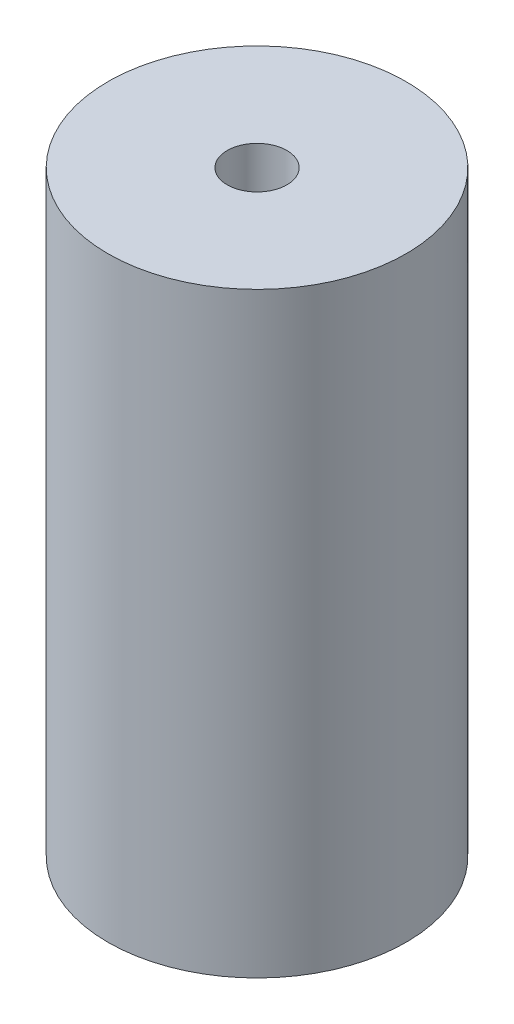
ISO-10303-21;
HEADER;
FILE_DESCRIPTION(('STEP AP214'),'2;1');
FILE_NAME('part.step','',(''),(''),'','','');
FILE_SCHEMA(('AUTOMOTIVE_DESIGN { 1 0 10303 214 1 1 1 1 }'));
ENDSEC;
DATA;
#1=APPLICATION_CONTEXT('core data for automotive mechanical design processes');
#2=APPLICATION_PROTOCOL_DEFINITION('international standard','automotive_design',2000,#1);
#3=PRODUCT_CONTEXT('',#1,'mechanical');
#4=PRODUCT('Part','Part','',(#3));
#5=PRODUCT_RELATED_PRODUCT_CATEGORY('part','',(#4));
#6=PRODUCT_DEFINITION_FORMATION('','',#4);
#7=PRODUCT_DEFINITION_CONTEXT('part definition',#1,'design');
#8=PRODUCT_DEFINITION('design','',#6,#7);
#9=PRODUCT_DEFINITION_SHAPE('','',#8);
#10=(LENGTH_UNIT() NAMED_UNIT(*) SI_UNIT(.MILLI.,.METRE.));
#11=(NAMED_UNIT(*) PLANE_ANGLE_UNIT() SI_UNIT($,.RADIAN.));
#12=(NAMED_UNIT(*) SI_UNIT($,.STERADIAN.) SOLID_ANGLE_UNIT());
#13=UNCERTAINTY_MEASURE_WITH_UNIT(LENGTH_MEASURE(1.E-05),#10,'distance_accuracy_value','');
#14=(GEOMETRIC_REPRESENTATION_CONTEXT(3) GLOBAL_UNCERTAINTY_ASSIGNED_CONTEXT((#13)) GLOBAL_UNIT_ASSIGNED_CONTEXT((#10,
#11,#12)) REPRESENTATION_CONTEXT('',''));
#15=CARTESIAN_POINT('',(0.,0.,0.));
#16=DIRECTION('',(0.,0.,1.));
#17=DIRECTION('',(1.,0.,0.));
#18=AXIS2_PLACEMENT_3D('',#15,#16,#17);
#19=CARTESIAN_POINT('',(0.,30.,0.));
#20=DIRECTION('',(0.,-1.,0.));
#21=DIRECTION('',(0.,0.,-1.));
#22=AXIS2_PLACEMENT_3D('',#19,#20,#21);
#23=CYLINDRICAL_SURFACE('',#22,7.5);
#24=CARTESIAN_POINT('',(0.,30.,0.));
#25=DIRECTION('',(0.,1.,0.));
#26=DIRECTION('',(0.,0.,1.));
#27=AXIS2_PLACEMENT_3D('',#24,#25,#26);
#28=CIRCLE('',#27,7.5);
#29=CARTESIAN_POINT('',(0.,30.,7.5));
#30=VERTEX_POINT('',#29);
#31=EDGE_CURVE('E10',#30,#30,#28,.T.);
#32=ORIENTED_EDGE('',*,*,#31,.F.);
#33=EDGE_LOOP('',(#32));
#34=FACE_BOUND('',#33,.T.);
#35=CARTESIAN_POINT('',(0.,0.,0.));
#36=DIRECTION('',(0.,1.,0.));
#37=DIRECTION('',(0.,0.,1.));
#38=AXIS2_PLACEMENT_3D('',#35,#36,#37);
#39=CIRCLE('',#38,7.5);
#40=CARTESIAN_POINT('',(0.,0.,7.5));
#41=VERTEX_POINT('',#40);
#42=EDGE_CURVE('E33',#41,#41,#39,.T.);
#43=ORIENTED_EDGE('',*,*,#42,.T.);
#44=EDGE_LOOP('',(#43));
#45=FACE_BOUND('',#44,.T.);
#46=ADVANCED_FACE('F30',(#34,#45),#23,.T.);
#47=CARTESIAN_POINT('',(0.,30.,0.));
#48=DIRECTION('',(0.,1.,0.));
#49=DIRECTION('',(0.,0.,1.));
#50=AXIS2_PLACEMENT_3D('',#47,#48,#49);
#51=PLANE('',#50);
#52=CARTESIAN_POINT('',(0.,30.,0.));
#53=DIRECTION('',(0.,1.,0.));
#54=DIRECTION('',(0.,0.,1.));
#55=AXIS2_PLACEMENT_3D('',#52,#53,#54);
#56=CIRCLE('',#55,1.5);
#57=CARTESIAN_POINT('',(0.,30.,1.5));
#58=VERTEX_POINT('',#57);
#59=EDGE_CURVE('E42',#58,#58,#56,.T.);
#60=ORIENTED_EDGE('',*,*,#59,.F.);
#61=EDGE_LOOP('',(#60));
#62=FACE_BOUND('',#61,.T.);
#63=ORIENTED_EDGE('',*,*,#31,.T.);
#64=EDGE_LOOP('',(#63));
#65=FACE_BOUND('',#64,.T.);
#66=ADVANCED_FACE('F57',(#62,#65),#51,.T.);
#67=CARTESIAN_POINT('',(0.,0.,0.));
#68=DIRECTION('',(0.,1.,0.));
#69=DIRECTION('',(0.,0.,1.));
#70=AXIS2_PLACEMENT_3D('',#67,#68,#69);
#71=PLANE('',#70);
#72=CARTESIAN_POINT('',(0.,0.,0.));
#73=DIRECTION('',(0.,1.,0.));
#74=DIRECTION('',(0.,0.,1.));
#75=AXIS2_PLACEMENT_3D('',#72,#73,#74);
#76=CIRCLE('',#75,1.5);
#77=CARTESIAN_POINT('',(0.,0.,1.5));
#78=VERTEX_POINT('',#77);
#79=EDGE_CURVE('E40',#78,#78,#76,.T.);
#80=ORIENTED_EDGE('',*,*,#79,.T.);
#81=EDGE_LOOP('',(#80));
#82=FACE_BOUND('',#81,.T.);
#83=ORIENTED_EDGE('',*,*,#42,.F.);
#84=EDGE_LOOP('',(#83));
#85=FACE_BOUND('',#84,.T.);
#86=ADVANCED_FACE('F48',(#82,#85),#71,.F.);
#87=CARTESIAN_POINT('',(0.,0.,0.));
#88=DIRECTION('',(0.,1.,0.));
#89=DIRECTION('',(0.,0.,1.));
#90=AXIS2_PLACEMENT_3D('',#87,#88,#89);
#91=CYLINDRICAL_SURFACE('',#90,1.5);
#92=ORIENTED_EDGE('',*,*,#79,.F.);
#93=EDGE_LOOP('',(#92));
#94=FACE_BOUND('',#93,.T.);
#95=ORIENTED_EDGE('',*,*,#59,.T.);
#96=EDGE_LOOP('',(#95));
#97=FACE_BOUND('',#96,.T.);
#98=ADVANCED_FACE('F51',(#94,#97),#91,.F.);
#99=CLOSED_SHELL('',(#46,#66,#86,#98));
#100=MANIFOLD_SOLID_BREP('B2',#99);
#101=ADVANCED_BREP_SHAPE_REPRESENTATION('',(#18,#100),#14);
#102=SHAPE_DEFINITION_REPRESENTATION(#9,#101);
ENDSEC;
END-ISO-10303-21;
